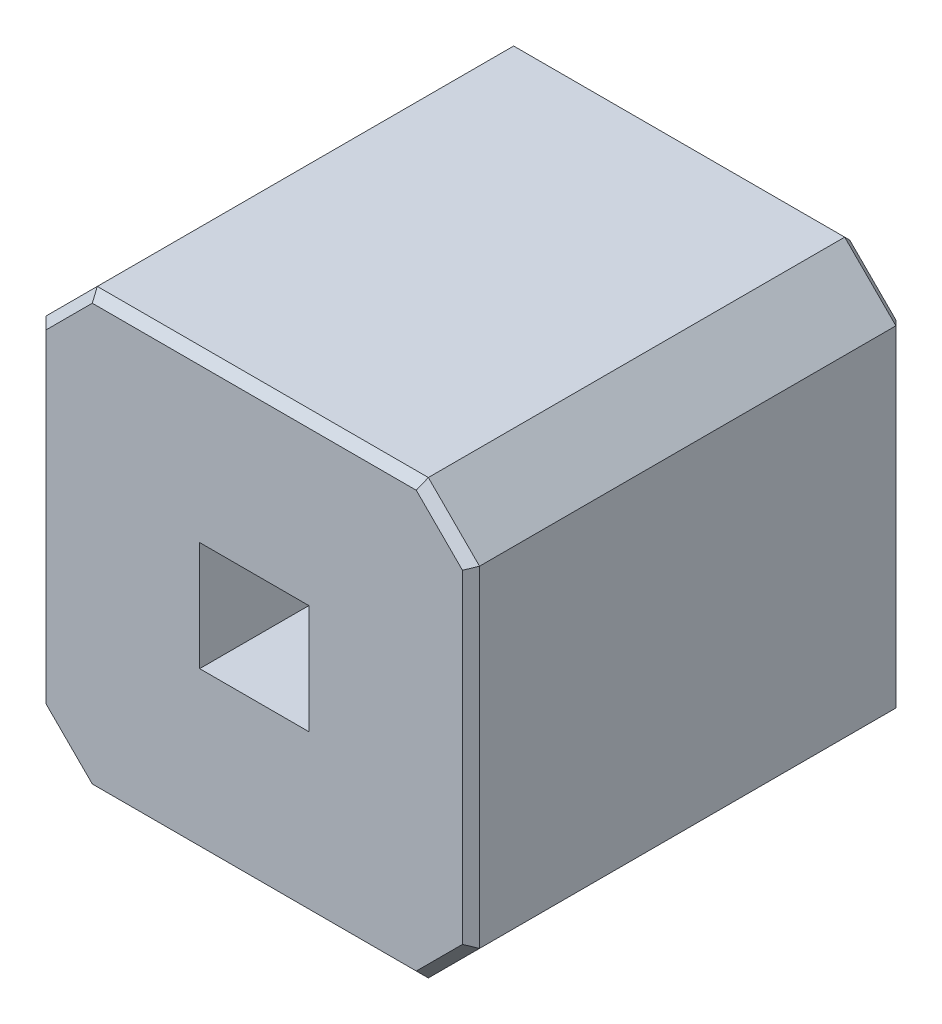
ISO-10303-21;
HEADER;
FILE_DESCRIPTION(('STEP AP214'),'2;1');
FILE_NAME('part.step','',(''),(''),'','','');
FILE_SCHEMA(('AUTOMOTIVE_DESIGN { 1 0 10303 214 1 1 1 1 }'));
ENDSEC;
DATA;
#1=APPLICATION_CONTEXT('core data for automotive mechanical design processes');
#2=APPLICATION_PROTOCOL_DEFINITION('international standard','automotive_design',2000,#1);
#3=PRODUCT_CONTEXT('',#1,'mechanical');
#4=PRODUCT('Part','Part','',(#3));
#5=PRODUCT_RELATED_PRODUCT_CATEGORY('part','',(#4));
#6=PRODUCT_DEFINITION_FORMATION('','',#4);
#7=PRODUCT_DEFINITION_CONTEXT('part definition',#1,'design');
#8=PRODUCT_DEFINITION('design','',#6,#7);
#9=PRODUCT_DEFINITION_SHAPE('','',#8);
#10=(LENGTH_UNIT() NAMED_UNIT(*) SI_UNIT(.MILLI.,.METRE.));
#11=(NAMED_UNIT(*) PLANE_ANGLE_UNIT() SI_UNIT($,.RADIAN.));
#12=(NAMED_UNIT(*) SI_UNIT($,.STERADIAN.) SOLID_ANGLE_UNIT());
#13=UNCERTAINTY_MEASURE_WITH_UNIT(LENGTH_MEASURE(1.E-05),#10,'distance_accuracy_value','');
#14=(GEOMETRIC_REPRESENTATION_CONTEXT(3) GLOBAL_UNCERTAINTY_ASSIGNED_CONTEXT((#13)) GLOBAL_UNIT_ASSIGNED_CONTEXT((#10,
#11,#12)) REPRESENTATION_CONTEXT('',''));
#15=CARTESIAN_POINT('',(0.,0.,0.));
#16=DIRECTION('',(0.,0.,1.));
#17=DIRECTION('',(1.,0.,0.));
#18=AXIS2_PLACEMENT_3D('',#15,#16,#17);
#19=CARTESIAN_POINT('',(1.084644660941,-1.084644660941,0.));
#20=DIRECTION('',(-0.49999999999984,0.49999999999984,0.707106781186774));
#21=DIRECTION('',(0.707106781186548,0.707106781186548,0.));
#22=AXIS2_PLACEMENT_3D('',#19,#20,#21);
#23=PLANE('',#22);
#24=DIRECTION('',(-0.678598344545825,0.281084637714928,-0.678598344545825));
#25=VECTOR('',#24,1.);
#26=CARTESIAN_POINT('',(1.327223070949,-0.993702572068,0.107223070949));
#27=LINE('',#26,#25);
#28=CARTESIAN_POINT('',(1.27,-0.97,0.05));
#29=VERTEX_POINT('',#28);
#30=CARTESIAN_POINT('',(1.22,-0.949289321881,0.));
#31=VERTEX_POINT('',#30);
#32=EDGE_CURVE('E258',#29,#31,#27,.T.);
#33=ORIENTED_EDGE('',*,*,#32,.F.);
#34=DIRECTION('',(0.707106781186548,0.707106781186548,0.));
#35=VECTOR('',#34,1.);
#36=CARTESIAN_POINT('',(1.22,-1.02,0.05));
#37=LINE('',#36,#35);
#38=CARTESIAN_POINT('',(0.97,-1.27,0.05));
#39=VERTEX_POINT('',#38);
#40=EDGE_CURVE('E239',#39,#29,#37,.T.);
#41=ORIENTED_EDGE('',*,*,#40,.F.);
#42=DIRECTION('',(-0.281084637714928,0.678598344545825,-0.678598344545825));
#43=VECTOR('',#42,1.);
#44=CARTESIAN_POINT('',(0.993702572068,-1.327223070949,0.107223070949));
#45=LINE('',#44,#43);
#46=CARTESIAN_POINT('',(0.949289321881,-1.22,0.));
#47=VERTEX_POINT('',#46);
#48=EDGE_CURVE('E11',#39,#47,#45,.T.);
#49=ORIENTED_EDGE('',*,*,#48,.T.);
#50=DIRECTION('',(-0.707106781186548,-0.707106781186548,0.));
#51=VECTOR('',#50,1.);
#52=CARTESIAN_POINT('',(0.934644660941,-1.234644660941,0.));
#53=LINE('',#52,#51);
#54=EDGE_CURVE('E317',#31,#47,#53,.T.);
#55=ORIENTED_EDGE('',*,*,#54,.F.);
#56=EDGE_LOOP('',(#33,#41,#49,#55));
#57=FACE_BOUND('',#56,.T.);
#58=ADVANCED_FACE('F17',(#57),#23,.F.);
#59=CARTESIAN_POINT('',(1.27,-1.27,0.05));
#60=DIRECTION('',(0.,0.707106781186548,0.707106781186548));
#61=DIRECTION('',(1.,0.,0.));
#62=AXIS2_PLACEMENT_3D('',#59,#60,#61);
#63=PLANE('',#62);
#64=DIRECTION('',(0.281084637714928,0.678598344545825,-0.678598344545825));
#65=VECTOR('',#64,1.);
#66=CARTESIAN_POINT('',(-0.792261948312,-0.840902385064,-0.379097614936));
#67=LINE('',#66,#65);
#68=CARTESIAN_POINT('',(-0.97,-1.27,0.05));
#69=VERTEX_POINT('',#68);
#70=CARTESIAN_POINT('',(-0.949289321881,-1.22,0.));
#71=VERTEX_POINT('',#70);
#72=EDGE_CURVE('E27',#69,#71,#67,.T.);
#73=ORIENTED_EDGE('',*,*,#72,.T.);
#74=DIRECTION('',(-1.,0.,0.));
#75=VECTOR('',#74,1.);
#76=CARTESIAN_POINT('',(-1.27,-1.22,0.));
#77=LINE('',#76,#75);
#78=EDGE_CURVE('E311',#47,#71,#77,.T.);
#79=ORIENTED_EDGE('',*,*,#78,.F.);
#80=ORIENTED_EDGE('',*,*,#48,.F.);
#81=DIRECTION('',(1.,0.,0.));
#82=VECTOR('',#81,1.);
#83=CARTESIAN_POINT('',(1.27,-1.27,0.05));
#84=LINE('',#83,#82);
#85=EDGE_CURVE('E364',#69,#39,#84,.T.);
#86=ORIENTED_EDGE('',*,*,#85,.F.);
#87=EDGE_LOOP('',(#73,#79,#80,#86));
#88=FACE_BOUND('',#87,.T.);
#89=ADVANCED_FACE('F713',(#88),#63,.F.);
#90=CARTESIAN_POINT('',(-2.354644660941,0.185355339059,0.));
#91=DIRECTION('',(0.49999999999984,0.49999999999984,0.707106781186774));
#92=DIRECTION('',(0.707106781186548,-0.707106781186548,0.));
#93=AXIS2_PLACEMENT_3D('',#90,#91,#92);
#94=PLANE('',#93);
#95=DIRECTION('',(0.678598344545825,0.281084637714928,-0.678598344545825));
#96=VECTOR('',#95,1.);
#97=CARTESIAN_POINT('',(-1.327223070949,-0.993702572068,0.107223070949));
#98=LINE('',#97,#96);
#99=CARTESIAN_POINT('',(-1.27,-0.97,0.05));
#100=VERTEX_POINT('',#99);
#101=CARTESIAN_POINT('',(-1.22,-0.949289321881,0.));
#102=VERTEX_POINT('',#101);
#103=EDGE_CURVE('E20',#100,#102,#98,.T.);
#104=ORIENTED_EDGE('',*,*,#103,.T.);
#105=DIRECTION('',(-0.707106781186548,0.707106781186548,0.));
#106=VECTOR('',#105,1.);
#107=CARTESIAN_POINT('',(-1.234644660941,-0.934644660941,0.));
#108=LINE('',#107,#106);
#109=EDGE_CURVE('E296',#71,#102,#108,.T.);
#110=ORIENTED_EDGE('',*,*,#109,.F.);
#111=ORIENTED_EDGE('',*,*,#72,.F.);
#112=DIRECTION('',(0.707106781186548,-0.707106781186548,0.));
#113=VECTOR('',#112,1.);
#114=CARTESIAN_POINT('',(-0.97,-1.27,0.05));
#115=LINE('',#114,#113);
#116=EDGE_CURVE('E240',#100,#69,#115,.T.);
#117=ORIENTED_EDGE('',*,*,#116,.F.);
#118=EDGE_LOOP('',(#104,#110,#111,#117));
#119=FACE_BOUND('',#118,.T.);
#120=ADVANCED_FACE('F294',(#119),#94,.F.);
#121=CARTESIAN_POINT('',(-1.27,-1.27,0.05));
#122=DIRECTION('',(0.707106781186548,0.,0.707106781186548));
#123=DIRECTION('',(0.,-1.,0.));
#124=AXIS2_PLACEMENT_3D('',#121,#122,#123);
#125=PLANE('',#124);
#126=DIRECTION('',(0.678598344545825,-0.281084637714928,-0.678598344545825));
#127=VECTOR('',#126,1.);
#128=CARTESIAN_POINT('',(-1.183487607169,0.934165393576,-0.03651239283051));
#129=LINE('',#128,#127);
#130=CARTESIAN_POINT('',(-1.27,0.97,0.05));
#131=VERTEX_POINT('',#130);
#132=CARTESIAN_POINT('',(-1.22,0.949289321881,0.));
#133=VERTEX_POINT('',#132);
#134=EDGE_CURVE('E280',#131,#133,#129,.T.);
#135=ORIENTED_EDGE('',*,*,#134,.T.);
#136=DIRECTION('',(0.,1.,0.));
#137=VECTOR('',#136,1.);
#138=CARTESIAN_POINT('',(-1.22,1.27,0.));
#139=LINE('',#138,#137);
#140=EDGE_CURVE('E300',#102,#133,#139,.T.);
#141=ORIENTED_EDGE('',*,*,#140,.F.);
#142=ORIENTED_EDGE('',*,*,#103,.F.);
#143=DIRECTION('',(0.,-1.,0.));
#144=VECTOR('',#143,1.);
#145=CARTESIAN_POINT('',(-1.27,-1.27,0.05));
#146=LINE('',#145,#144);
#147=EDGE_CURVE('E348',#131,#100,#146,.T.);
#148=ORIENTED_EDGE('',*,*,#147,.F.);
#149=EDGE_LOOP('',(#135,#141,#142,#148));
#150=FACE_BOUND('',#149,.T.);
#151=ADVANCED_FACE('F301',(#150),#125,.F.);
#152=CARTESIAN_POINT('',(-1.084644660941,1.084644660941,0.));
#153=DIRECTION('',(0.49999999999984,-0.49999999999984,0.707106781186774));
#154=DIRECTION('',(-0.707106781186548,-0.707106781186548,0.));
#155=AXIS2_PLACEMENT_3D('',#152,#153,#154);
#156=PLANE('',#155);
#157=DIRECTION('',(-0.281084637714928,0.678598344545825,0.678598344545825));
#158=VECTOR('',#157,1.);
#159=CARTESIAN_POINT('',(-0.793020795227,0.84273440358,-0.37726559642));
#160=LINE('',#159,#158);
#161=CARTESIAN_POINT('',(-0.949289321881,1.22,0.));
#162=VERTEX_POINT('',#161);
#163=CARTESIAN_POINT('',(-0.97,1.27,0.05));
#164=VERTEX_POINT('',#163);
#165=EDGE_CURVE('E190',#162,#164,#160,.T.);
#166=ORIENTED_EDGE('',*,*,#165,.F.);
#167=DIRECTION('',(0.707106781186548,0.707106781186548,0.));
#168=VECTOR('',#167,1.);
#169=CARTESIAN_POINT('',(-0.984644660941,1.184644660941,0.));
#170=LINE('',#169,#168);
#171=EDGE_CURVE('E305',#133,#162,#170,.T.);
#172=ORIENTED_EDGE('',*,*,#171,.F.);
#173=ORIENTED_EDGE('',*,*,#134,.F.);
#174=DIRECTION('',(-0.707106781186548,-0.707106781186548,0.));
#175=VECTOR('',#174,1.);
#176=CARTESIAN_POINT('',(-1.27,0.97,0.05));
#177=LINE('',#176,#175);
#178=EDGE_CURVE('E256',#164,#131,#177,.T.);
#179=ORIENTED_EDGE('',*,*,#178,.F.);
#180=EDGE_LOOP('',(#166,#172,#173,#179));
#181=FACE_BOUND('',#180,.T.);
#182=ADVANCED_FACE('F711',(#181),#156,.F.);
#183=CARTESIAN_POINT('',(-1.084644660941,1.084644660941,2.54));
#184=DIRECTION('',(-0.49999999999984,0.49999999999984,0.707106781186774));
#185=DIRECTION('',(0.707106781186548,0.707106781186548,0.));
#186=AXIS2_PLACEMENT_3D('',#183,#184,#185);
#187=PLANE('',#186);
#188=DIRECTION('',(-0.281084637714928,0.678598344545825,-0.678598344545825));
#189=VECTOR('',#188,1.);
#190=CARTESIAN_POINT('',(-0.974628215085,1.281173499627,2.478826500373));
#191=LINE('',#190,#189);
#192=CARTESIAN_POINT('',(-0.949289321881,1.22,2.54));
#193=VERTEX_POINT('',#192);
#194=CARTESIAN_POINT('',(-0.97,1.27,2.49));
#195=VERTEX_POINT('',#194);
#196=EDGE_CURVE('E40',#193,#195,#191,.T.);
#197=ORIENTED_EDGE('',*,*,#196,.T.);
#198=DIRECTION('',(0.707106781186548,0.707106781186548,0.));
#199=VECTOR('',#198,1.);
#200=CARTESIAN_POINT('',(-1.27,0.97,2.49));
#201=LINE('',#200,#199);
#202=CARTESIAN_POINT('',(-1.27,0.97,2.49));
#203=VERTEX_POINT('',#202);
#204=EDGE_CURVE('E203',#203,#195,#201,.T.);
#205=ORIENTED_EDGE('',*,*,#204,.F.);
#206=DIRECTION('',(0.678598344545825,-0.281084637714928,0.678598344545825));
#207=VECTOR('',#206,1.);
#208=CARTESIAN_POINT('',(-1.281173499627,0.974628215085,2.478826500373));
#209=LINE('',#208,#207);
#210=CARTESIAN_POINT('',(-1.22,0.949289321881,2.54));
#211=VERTEX_POINT('',#210);
#212=EDGE_CURVE('E277',#203,#211,#209,.T.);
#213=ORIENTED_EDGE('',*,*,#212,.T.);
#214=DIRECTION('',(-0.707106781186548,-0.707106781186548,0.));
#215=VECTOR('',#214,1.);
#216=CARTESIAN_POINT('',(-1.084644660941,1.084644660941,2.54));
#217=LINE('',#216,#215);
#218=EDGE_CURVE('E436',#193,#211,#217,.T.);
#219=ORIENTED_EDGE('',*,*,#218,.F.);
#220=EDGE_LOOP('',(#197,#205,#213,#219));
#221=FACE_BOUND('',#220,.T.);
#222=ADVANCED_FACE('F434',(#221),#187,.T.);
#223=CARTESIAN_POINT('',(-1.22,1.27,2.54));
#224=DIRECTION('',(-0.707106781186548,0.,0.707106781186548));
#225=DIRECTION('',(0.,1.,0.));
#226=AXIS2_PLACEMENT_3D('',#223,#224,#225);
#227=PLANE('',#226);
#228=DIRECTION('',(0.678598344545825,0.281084637714928,0.678598344545825));
#229=VECTOR('',#228,1.);
#230=CARTESIAN_POINT('',(-1.526072829275,-1.076068838841,2.233927170725));
#231=LINE('',#230,#229);
#232=CARTESIAN_POINT('',(-1.27,-0.97,2.49));
#233=VERTEX_POINT('',#232);
#234=CARTESIAN_POINT('',(-1.22,-0.949289321881,2.54));
#235=VERTEX_POINT('',#234);
#236=EDGE_CURVE('E271',#233,#235,#231,.T.);
#237=ORIENTED_EDGE('',*,*,#236,.T.);
#238=DIRECTION('',(0.,-1.,0.));
#239=VECTOR('',#238,1.);
#240=CARTESIAN_POINT('',(-1.22,-0.97,2.54));
#241=LINE('',#240,#239);
#242=EDGE_CURVE('E441',#211,#235,#241,.T.);
#243=ORIENTED_EDGE('',*,*,#242,.F.);
#244=ORIENTED_EDGE('',*,*,#212,.F.);
#245=DIRECTION('',(0.,1.,0.));
#246=VECTOR('',#245,1.);
#247=CARTESIAN_POINT('',(-1.27,0.97,2.49));
#248=LINE('',#247,#246);
#249=EDGE_CURVE('E356',#233,#203,#248,.T.);
#250=ORIENTED_EDGE('',*,*,#249,.F.);
#251=EDGE_LOOP('',(#237,#243,#244,#250));
#252=FACE_BOUND('',#251,.T.);
#253=ADVANCED_FACE('F442',(#252),#227,.T.);
#254=CARTESIAN_POINT('',(-1.27,1.22,2.54));
#255=DIRECTION('',(0.,0.707106781186548,0.707106781186548));
#256=DIRECTION('',(1.,0.,0.));
#257=AXIS2_PLACEMENT_3D('',#254,#255,#256);
#258=PLANE('',#257);
#259=DIRECTION('',(0.281084637714928,0.678598344545825,-0.678598344545825));
#260=VECTOR('',#259,1.);
#261=CARTESIAN_POINT('',(0.773946438244,0.796684832258,2.963315167742));
#262=LINE('',#261,#260);
#263=CARTESIAN_POINT('',(0.949289321881,1.22,2.54));
#264=VERTEX_POINT('',#263);
#265=CARTESIAN_POINT('',(0.97,1.27,2.49));
#266=VERTEX_POINT('',#265);
#267=EDGE_CURVE('E268',#264,#266,#262,.T.);
#268=ORIENTED_EDGE('',*,*,#267,.T.);
#269=DIRECTION('',(1.,0.,0.));
#270=VECTOR('',#269,1.);
#271=CARTESIAN_POINT('',(0.97,1.27,2.49));
#272=LINE('',#271,#270);
#273=EDGE_CURVE('E217',#195,#266,#272,.T.);
#274=ORIENTED_EDGE('',*,*,#273,.F.);
#275=ORIENTED_EDGE('',*,*,#196,.F.);
#276=DIRECTION('',(-1.,0.,0.));
#277=VECTOR('',#276,1.);
#278=CARTESIAN_POINT('',(-0.97,1.22,2.54));
#279=LINE('',#278,#277);
#280=EDGE_CURVE('E449',#264,#193,#279,.T.);
#281=ORIENTED_EDGE('',*,*,#280,.F.);
#282=EDGE_LOOP('',(#268,#274,#275,#281));
#283=FACE_BOUND('',#282,.T.);
#284=ADVANCED_FACE('F706',(#283),#258,.T.);
#285=CARTESIAN_POINT('',(-2.354644660941,0.185355339059,2.54));
#286=DIRECTION('',(-0.49999999999984,-0.49999999999984,0.707106781186774));
#287=DIRECTION('',(-0.707106781186548,0.707106781186548,0.));
#288=AXIS2_PLACEMENT_3D('',#285,#286,#287);
#289=PLANE('',#288);
#290=DIRECTION('',(0.281084637714928,0.678598344545825,0.678598344545825));
#291=VECTOR('',#290,1.);
#292=CARTESIAN_POINT('',(-0.974628215085,-1.281173499627,2.478826500373));
#293=LINE('',#292,#291);
#294=CARTESIAN_POINT('',(-0.97,-1.27,2.49));
#295=VERTEX_POINT('',#294);
#296=CARTESIAN_POINT('',(-0.949289321881,-1.22,2.54));
#297=VERTEX_POINT('',#296);
#298=EDGE_CURVE('E272',#295,#297,#293,.T.);
#299=ORIENTED_EDGE('',*,*,#298,.T.);
#300=DIRECTION('',(0.707106781186548,-0.707106781186548,0.));
#301=VECTOR('',#300,1.);
#302=CARTESIAN_POINT('',(-2.354644660941,0.185355339059,2.54));
#303=LINE('',#302,#301);
#304=EDGE_CURVE('E446',#235,#297,#303,.T.);
#305=ORIENTED_EDGE('',*,*,#304,.F.);
#306=ORIENTED_EDGE('',*,*,#236,.F.);
#307=DIRECTION('',(-0.707106781186548,0.707106781186548,0.));
#308=VECTOR('',#307,1.);
#309=CARTESIAN_POINT('',(-0.97,-1.27,2.49));
#310=LINE('',#309,#308);
#311=EDGE_CURVE('E235',#295,#233,#310,.T.);
#312=ORIENTED_EDGE('',*,*,#311,.F.);
#313=EDGE_LOOP('',(#299,#305,#306,#312));
#314=FACE_BOUND('',#313,.T.);
#315=ADVANCED_FACE('F694',(#314),#289,.T.);
#316=CARTESIAN_POINT('',(-0.185355339059,2.354644660941,2.54));
#317=DIRECTION('',(0.49999999999984,0.49999999999984,0.707106781186774));
#318=DIRECTION('',(0.707106781186548,-0.707106781186548,0.));
#319=AXIS2_PLACEMENT_3D('',#316,#317,#318);
#320=PLANE('',#319);
#321=DIRECTION('',(0.678598344545825,0.281084637714928,-0.678598344545825));
#322=VECTOR('',#321,1.);
#323=CARTESIAN_POINT('',(0.840902385064,0.792261948312,2.919097614936));
#324=LINE('',#323,#322);
#325=CARTESIAN_POINT('',(1.22,0.949289321881,2.54));
#326=VERTEX_POINT('',#325);
#327=CARTESIAN_POINT('',(1.27,0.97,2.49));
#328=VERTEX_POINT('',#327);
#329=EDGE_CURVE('E267',#326,#328,#324,.T.);
#330=ORIENTED_EDGE('',*,*,#329,.T.);
#331=DIRECTION('',(0.707106781186548,-0.707106781186548,0.));
#332=VECTOR('',#331,1.);
#333=CARTESIAN_POINT('',(0.97,1.27,2.49));
#334=LINE('',#333,#332);
#335=EDGE_CURVE('E202',#266,#328,#334,.T.);
#336=ORIENTED_EDGE('',*,*,#335,.F.);
#337=ORIENTED_EDGE('',*,*,#267,.F.);
#338=DIRECTION('',(-0.707106781186548,0.707106781186548,0.));
#339=VECTOR('',#338,1.);
#340=CARTESIAN_POINT('',(-0.185355339059,2.354644660941,2.54));
#341=LINE('',#340,#339);
#342=EDGE_CURVE('E490',#326,#264,#341,.T.);
#343=ORIENTED_EDGE('',*,*,#342,.F.);
#344=EDGE_LOOP('',(#330,#336,#337,#343));
#345=FACE_BOUND('',#344,.T.);
#346=ADVANCED_FACE('F705',(#345),#320,.T.);
#347=CARTESIAN_POINT('',(-1.27,-1.22,2.54));
#348=DIRECTION('',(0.,-0.707106781186548,0.707106781186548));
#349=DIRECTION('',(-1.,0.,0.));
#350=AXIS2_PLACEMENT_3D('',#347,#348,#349);
#351=PLANE('',#350);
#352=DIRECTION('',(-0.281084637714928,0.678598344545825,0.678598344545825));
#353=VECTOR('',#352,1.);
#354=CARTESIAN_POINT('',(0.934165393576,-1.183487607169,2.576512392831));
#355=LINE('',#354,#353);
#356=CARTESIAN_POINT('',(0.97,-1.27,2.49));
#357=VERTEX_POINT('',#356);
#358=CARTESIAN_POINT('',(0.949289321881,-1.22,2.54));
#359=VERTEX_POINT('',#358);
#360=EDGE_CURVE('E261',#357,#359,#355,.T.);
#361=ORIENTED_EDGE('',*,*,#360,.T.);
#362=DIRECTION('',(1.,0.,0.));
#363=VECTOR('',#362,1.);
#364=CARTESIAN_POINT('',(0.97,-1.22,2.54));
#365=LINE('',#364,#363);
#366=EDGE_CURVE('E468',#297,#359,#365,.T.);
#367=ORIENTED_EDGE('',*,*,#366,.F.);
#368=ORIENTED_EDGE('',*,*,#298,.F.);
#369=DIRECTION('',(-1.,0.,0.));
#370=VECTOR('',#369,1.);
#371=CARTESIAN_POINT('',(-0.97,-1.27,2.49));
#372=LINE('',#371,#370);
#373=EDGE_CURVE('E371',#357,#295,#372,.T.);
#374=ORIENTED_EDGE('',*,*,#373,.F.);
#375=EDGE_LOOP('',(#361,#367,#368,#374));
#376=FACE_BOUND('',#375,.T.);
#377=ADVANCED_FACE('F698',(#376),#351,.T.);
#378=CARTESIAN_POINT('',(1.22,1.27,2.54));
#379=DIRECTION('',(0.707106781186548,0.,0.707106781186548));
#380=DIRECTION('',(0.,-1.,0.));
#381=AXIS2_PLACEMENT_3D('',#378,#379,#380);
#382=PLANE('',#381);
#383=DIRECTION('',(0.678598344545825,-0.281084637714928,-0.678598344545825));
#384=VECTOR('',#383,1.);
#385=CARTESIAN_POINT('',(0.796684832258,-0.773946438244,2.963315167742));
#386=LINE('',#385,#384);
#387=CARTESIAN_POINT('',(1.22,-0.949289321881,2.54));
#388=VERTEX_POINT('',#387);
#389=CARTESIAN_POINT('',(1.27,-0.97,2.49));
#390=VERTEX_POINT('',#389);
#391=EDGE_CURVE('E264',#388,#390,#386,.T.);
#392=ORIENTED_EDGE('',*,*,#391,.T.);
#393=DIRECTION('',(0.,-1.,0.));
#394=VECTOR('',#393,1.);
#395=CARTESIAN_POINT('',(1.27,-0.97,2.49));
#396=LINE('',#395,#394);
#397=EDGE_CURVE('E219',#328,#390,#396,.T.);
#398=ORIENTED_EDGE('',*,*,#397,.F.);
#399=ORIENTED_EDGE('',*,*,#329,.F.);
#400=DIRECTION('',(0.,1.,0.));
#401=VECTOR('',#400,1.);
#402=CARTESIAN_POINT('',(1.22,0.97,2.54));
#403=LINE('',#402,#401);
#404=EDGE_CURVE('E483',#388,#326,#403,.T.);
#405=ORIENTED_EDGE('',*,*,#404,.F.);
#406=EDGE_LOOP('',(#392,#398,#399,#405));
#407=FACE_BOUND('',#406,.T.);
#408=ADVANCED_FACE('F704',(#407),#382,.T.);
#409=CARTESIAN_POINT('',(1.084644660941,-1.084644660941,2.54));
#410=DIRECTION('',(0.49999999999984,-0.49999999999984,0.707106781186774));
#411=DIRECTION('',(-0.707106781186548,-0.707106781186548,0.));
#412=AXIS2_PLACEMENT_3D('',#409,#410,#411);
#413=PLANE('',#412);
#414=ORIENTED_EDGE('',*,*,#360,.F.);
#415=DIRECTION('',(-0.707106781186548,-0.707106781186548,0.));
#416=VECTOR('',#415,1.);
#417=CARTESIAN_POINT('',(1.27,-0.97,2.49));
#418=LINE('',#417,#416);
#419=EDGE_CURVE('E253',#390,#357,#418,.T.);
#420=ORIENTED_EDGE('',*,*,#419,.F.);
#421=ORIENTED_EDGE('',*,*,#391,.F.);
#422=DIRECTION('',(0.707106781186548,0.707106781186548,0.));
#423=VECTOR('',#422,1.);
#424=CARTESIAN_POINT('',(1.084644660941,-1.084644660941,2.54));
#425=LINE('',#424,#423);
#426=EDGE_CURVE('E479',#359,#388,#425,.T.);
#427=ORIENTED_EDGE('',*,*,#426,.F.);
#428=EDGE_LOOP('',(#414,#420,#421,#427));
#429=FACE_BOUND('',#428,.T.);
#430=ADVANCED_FACE('F701',(#429),#413,.T.);
#431=CARTESIAN_POINT('',(1.27,-1.27,0.05));
#432=DIRECTION('',(-0.707106781186548,0.,0.707106781186548));
#433=DIRECTION('',(0.,1.,0.));
#434=AXIS2_PLACEMENT_3D('',#431,#432,#433);
#435=PLANE('',#434);
#436=DIRECTION('',(0.,1.,0.));
#437=VECTOR('',#436,1.);
#438=CARTESIAN_POINT('',(1.27,-1.27,0.05));
#439=LINE('',#438,#437);
#440=CARTESIAN_POINT('',(1.27,0.97,0.05));
#441=VERTEX_POINT('',#440);
#442=EDGE_CURVE('E379',#29,#441,#439,.T.);
#443=ORIENTED_EDGE('',*,*,#442,.F.);
#444=ORIENTED_EDGE('',*,*,#32,.T.);
#445=DIRECTION('',(0.,-1.,0.));
#446=VECTOR('',#445,1.);
#447=CARTESIAN_POINT('',(1.22,1.27,0.));
#448=LINE('',#447,#446);
#449=CARTESIAN_POINT('',(1.22,0.949289321881,0.));
#450=VERTEX_POINT('',#449);
#451=EDGE_CURVE('E460',#450,#31,#448,.T.);
#452=ORIENTED_EDGE('',*,*,#451,.F.);
#453=DIRECTION('',(0.678598344545825,0.281084637714928,0.678598344545825));
#454=VECTOR('',#453,1.);
#455=CARTESIAN_POINT('',(0.840902385064,0.792261948312,-0.379097614936));
#456=LINE('',#455,#454);
#457=EDGE_CURVE('E189',#450,#441,#456,.T.);
#458=ORIENTED_EDGE('',*,*,#457,.T.);
#459=EDGE_LOOP('',(#443,#444,#452,#458));
#460=FACE_BOUND('',#459,.T.);
#461=ADVANCED_FACE('F392',(#460),#435,.F.);
#462=CARTESIAN_POINT('',(-0.185355339059,2.354644660941,0.));
#463=DIRECTION('',(-0.49999999999984,-0.49999999999984,0.707106781186774));
#464=DIRECTION('',(-0.707106781186548,0.707106781186548,0.));
#465=AXIS2_PLACEMENT_3D('',#462,#463,#464);
#466=PLANE('',#465);
#467=DIRECTION('',(0.281084637714928,0.678598344545825,0.678598344545825));
#468=VECTOR('',#467,1.);
#469=CARTESIAN_POINT('',(0.993702572068,1.327223070949,0.107223070949));
#470=LINE('',#469,#468);
#471=CARTESIAN_POINT('',(0.949289321881,1.22,0.));
#472=VERTEX_POINT('',#471);
#473=CARTESIAN_POINT('',(0.97,1.27,0.05));
#474=VERTEX_POINT('',#473);
#475=EDGE_CURVE('E177',#472,#474,#470,.T.);
#476=ORIENTED_EDGE('',*,*,#475,.T.);
#477=DIRECTION('',(-0.707106781186548,0.707106781186548,0.));
#478=VECTOR('',#477,1.);
#479=CARTESIAN_POINT('',(0.97,1.27,0.05));
#480=LINE('',#479,#478);
#481=EDGE_CURVE('E180',#441,#474,#480,.T.);
#482=ORIENTED_EDGE('',*,*,#481,.F.);
#483=ORIENTED_EDGE('',*,*,#457,.F.);
#484=DIRECTION('',(0.707106781186548,-0.707106781186548,0.));
#485=VECTOR('',#484,1.);
#486=CARTESIAN_POINT('',(1.234644660941,0.934644660941,0.));
#487=LINE('',#486,#485);
#488=EDGE_CURVE('E183',#472,#450,#487,.T.);
#489=ORIENTED_EDGE('',*,*,#488,.F.);
#490=EDGE_LOOP('',(#476,#482,#483,#489));
#491=FACE_BOUND('',#490,.T.);
#492=ADVANCED_FACE('F179',(#491),#466,.F.);
#493=CARTESIAN_POINT('',(1.27,1.27,0.05));
#494=DIRECTION('',(0.,-0.707106781186548,0.707106781186548));
#495=DIRECTION('',(-1.,0.,0.));
#496=AXIS2_PLACEMENT_3D('',#493,#494,#495);
#497=PLANE('',#496);
#498=DIRECTION('',(1.,0.,0.));
#499=VECTOR('',#498,1.);
#500=CARTESIAN_POINT('',(-1.27,1.22,0.));
#501=LINE('',#500,#499);
#502=EDGE_CURVE('E327',#162,#472,#501,.T.);
#503=ORIENTED_EDGE('',*,*,#502,.F.);
#504=ORIENTED_EDGE('',*,*,#165,.T.);
#505=DIRECTION('',(-1.,0.,0.));
#506=VECTOR('',#505,1.);
#507=CARTESIAN_POINT('',(1.27,1.27,0.05));
#508=LINE('',#507,#506);
#509=EDGE_CURVE('E206',#474,#164,#508,.T.);
#510=ORIENTED_EDGE('',*,*,#509,.F.);
#511=ORIENTED_EDGE('',*,*,#475,.F.);
#512=EDGE_LOOP('',(#503,#504,#510,#511));
#513=FACE_BOUND('',#512,.T.);
#514=ADVANCED_FACE('F207',(#513),#497,.F.);
#515=CARTESIAN_POINT('',(0.97,1.27,2.54));
#516=DIRECTION('',(-0.707106781186548,-0.707106781186548,0.));
#517=DIRECTION('',(-0.707106781186548,0.707106781186548,0.));
#518=AXIS2_PLACEMENT_3D('',#515,#516,#517);
#519=PLANE('',#518);
#520=DIRECTION('',(0.,0.,1.));
#521=VECTOR('',#520,1.);
#522=CARTESIAN_POINT('',(1.27,0.97,2.54));
#523=LINE('',#522,#521);
#524=EDGE_CURVE('E199',#441,#328,#523,.T.);
#525=ORIENTED_EDGE('',*,*,#524,.F.);
#526=ORIENTED_EDGE('',*,*,#481,.T.);
#527=DIRECTION('',(0.,0.,-1.));
#528=VECTOR('',#527,1.);
#529=CARTESIAN_POINT('',(0.97,1.27,2.54));
#530=LINE('',#529,#528);
#531=EDGE_CURVE('E197',#266,#474,#530,.T.);
#532=ORIENTED_EDGE('',*,*,#531,.F.);
#533=ORIENTED_EDGE('',*,*,#335,.T.);
#534=EDGE_LOOP('',(#525,#526,#532,#533));
#535=FACE_BOUND('',#534,.T.);
#536=ADVANCED_FACE('F194',(#535),#519,.F.);
#537=CARTESIAN_POINT('',(-1.27,0.97,2.54));
#538=DIRECTION('',(0.707106781186548,-0.707106781186548,0.));
#539=DIRECTION('',(0.,0.,-1.));
#540=AXIS2_PLACEMENT_3D('',#537,#538,#539);
#541=PLANE('',#540);
#542=DIRECTION('',(0.,0.,1.));
#543=VECTOR('',#542,1.);
#544=CARTESIAN_POINT('',(-0.97,1.27,2.54));
#545=LINE('',#544,#543);
#546=EDGE_CURVE('E212',#164,#195,#545,.T.);
#547=ORIENTED_EDGE('',*,*,#546,.F.);
#548=ORIENTED_EDGE('',*,*,#178,.T.);
#549=DIRECTION('',(0.,0.,-1.));
#550=VECTOR('',#549,1.);
#551=CARTESIAN_POINT('',(-1.27,0.97,2.54));
#552=LINE('',#551,#550);
#553=EDGE_CURVE('E344',#203,#131,#552,.T.);
#554=ORIENTED_EDGE('',*,*,#553,.F.);
#555=ORIENTED_EDGE('',*,*,#204,.T.);
#556=EDGE_LOOP('',(#547,#548,#554,#555));
#557=FACE_BOUND('',#556,.T.);
#558=ADVANCED_FACE('F709',(#557),#541,.F.);
#559=CARTESIAN_POINT('',(1.27,-0.97,2.54));
#560=DIRECTION('',(-0.707106781186548,0.707106781186548,0.));
#561=DIRECTION('',(0.,0.,1.));
#562=AXIS2_PLACEMENT_3D('',#559,#560,#561);
#563=PLANE('',#562);
#564=DIRECTION('',(0.,0.,1.));
#565=VECTOR('',#564,1.);
#566=CARTESIAN_POINT('',(0.97,-1.27,2.54));
#567=LINE('',#566,#565);
#568=EDGE_CURVE('E370',#39,#357,#567,.T.);
#569=ORIENTED_EDGE('',*,*,#568,.F.);
#570=ORIENTED_EDGE('',*,*,#40,.T.);
#571=DIRECTION('',(0.,0.,-1.));
#572=VECTOR('',#571,1.);
#573=CARTESIAN_POINT('',(1.27,-0.97,2.54));
#574=LINE('',#573,#572);
#575=EDGE_CURVE('E375',#390,#29,#574,.T.);
#576=ORIENTED_EDGE('',*,*,#575,.F.);
#577=ORIENTED_EDGE('',*,*,#419,.T.);
#578=EDGE_LOOP('',(#569,#570,#576,#577));
#579=FACE_BOUND('',#578,.T.);
#580=ADVANCED_FACE('F744',(#579),#563,.F.);
#581=CARTESIAN_POINT('',(-0.97,-1.27,2.54));
#582=DIRECTION('',(0.707106781186548,0.707106781186548,0.));
#583=DIRECTION('',(0.,0.,-1.));
#584=AXIS2_PLACEMENT_3D('',#581,#582,#583);
#585=PLANE('',#584);
#586=DIRECTION('',(0.,0.,1.));
#587=VECTOR('',#586,1.);
#588=CARTESIAN_POINT('',(-1.27,-0.97,2.54));
#589=LINE('',#588,#587);
#590=EDGE_CURVE('E320',#100,#233,#589,.T.);
#591=ORIENTED_EDGE('',*,*,#590,.F.);
#592=ORIENTED_EDGE('',*,*,#116,.T.);
#593=DIRECTION('',(0.,0.,-1.));
#594=VECTOR('',#593,1.);
#595=CARTESIAN_POINT('',(-0.97,-1.27,2.54));
#596=LINE('',#595,#594);
#597=EDGE_CURVE('E360',#295,#69,#596,.T.);
#598=ORIENTED_EDGE('',*,*,#597,.F.);
#599=ORIENTED_EDGE('',*,*,#311,.T.);
#600=EDGE_LOOP('',(#591,#592,#598,#599));
#601=FACE_BOUND('',#600,.T.);
#602=ADVANCED_FACE('F691',(#601),#585,.F.);
#603=CARTESIAN_POINT('',(0.32,0.32,2.54));
#604=DIRECTION('',(0.,-1.,0.));
#605=DIRECTION('',(0.,0.,-1.));
#606=AXIS2_PLACEMENT_3D('',#603,#604,#605);
#607=PLANE('',#606);
#608=DIRECTION('',(-1.,0.,0.));
#609=VECTOR('',#608,1.);
#610=CARTESIAN_POINT('',(0.32,0.32,0.));
#611=LINE('',#610,#609);
#612=CARTESIAN_POINT('',(0.32,0.32,0.));
#613=VERTEX_POINT('',#612);
#614=CARTESIAN_POINT('',(-0.32,0.32,0.));
#615=VERTEX_POINT('',#614);
#616=EDGE_CURVE('E349',#613,#615,#611,.T.);
#617=ORIENTED_EDGE('',*,*,#616,.F.);
#618=DIRECTION('',(0.,0.,-1.));
#619=VECTOR('',#618,1.);
#620=CARTESIAN_POINT('',(0.32,0.32,2.54));
#621=LINE('',#620,#619);
#622=CARTESIAN_POINT('',(0.32,0.32,2.54));
#623=VERTEX_POINT('',#622);
#624=EDGE_CURVE('E244',#623,#613,#621,.T.);
#625=ORIENTED_EDGE('',*,*,#624,.F.);
#626=DIRECTION('',(-1.,0.,0.));
#627=VECTOR('',#626,1.);
#628=CARTESIAN_POINT('',(0.32,0.32,2.54));
#629=LINE('',#628,#627);
#630=CARTESIAN_POINT('',(-0.32,0.32,2.54));
#631=VERTEX_POINT('',#630);
#632=EDGE_CURVE('E475',#623,#631,#629,.T.);
#633=ORIENTED_EDGE('',*,*,#632,.T.);
#634=DIRECTION('',(0.,0.,-1.));
#635=VECTOR('',#634,1.);
#636=CARTESIAN_POINT('',(-0.32,0.32,2.54));
#637=LINE('',#636,#635);
#638=EDGE_CURVE('E231',#631,#615,#637,.T.);
#639=ORIENTED_EDGE('',*,*,#638,.T.);
#640=EDGE_LOOP('',(#617,#625,#633,#639));
#641=FACE_BOUND('',#640,.T.);
#642=ADVANCED_FACE('F761',(#641),#607,.T.);
#643=CARTESIAN_POINT('',(0.32,-0.32,2.54));
#644=DIRECTION('',(-1.,0.,0.));
#645=DIRECTION('',(0.,0.,1.));
#646=AXIS2_PLACEMENT_3D('',#643,#644,#645);
#647=PLANE('',#646);
#648=DIRECTION('',(0.,1.,0.));
#649=VECTOR('',#648,1.);
#650=CARTESIAN_POINT('',(0.32,-0.32,0.));
#651=LINE('',#650,#649);
#652=CARTESIAN_POINT('',(0.32,-0.32,0.));
#653=VERTEX_POINT('',#652);
#654=EDGE_CURVE('E343',#653,#613,#651,.T.);
#655=ORIENTED_EDGE('',*,*,#654,.F.);
#656=DIRECTION('',(0.,0.,-1.));
#657=VECTOR('',#656,1.);
#658=CARTESIAN_POINT('',(0.32,-0.32,2.54));
#659=LINE('',#658,#657);
#660=CARTESIAN_POINT('',(0.32,-0.32,2.54));
#661=VERTEX_POINT('',#660);
#662=EDGE_CURVE('E243',#661,#653,#659,.T.);
#663=ORIENTED_EDGE('',*,*,#662,.F.);
#664=DIRECTION('',(0.,1.,0.));
#665=VECTOR('',#664,1.);
#666=CARTESIAN_POINT('',(0.32,-0.32,2.54));
#667=LINE('',#666,#665);
#668=EDGE_CURVE('E463',#661,#623,#667,.T.);
#669=ORIENTED_EDGE('',*,*,#668,.T.);
#670=ORIENTED_EDGE('',*,*,#624,.T.);
#671=EDGE_LOOP('',(#655,#663,#669,#670));
#672=FACE_BOUND('',#671,.T.);
#673=ADVANCED_FACE('F752',(#672),#647,.T.);
#674=CARTESIAN_POINT('',(0.32,-0.32,2.54));
#675=DIRECTION('',(0.,1.,0.));
#676=DIRECTION('',(1.,0.,0.));
#677=AXIS2_PLACEMENT_3D('',#674,#675,#676);
#678=PLANE('',#677);
#679=DIRECTION('',(1.,0.,0.));
#680=VECTOR('',#679,1.);
#681=CARTESIAN_POINT('',(0.32,-0.32,0.));
#682=LINE('',#681,#680);
#683=CARTESIAN_POINT('',(-0.32,-0.32,0.));
#684=VERTEX_POINT('',#683);
#685=EDGE_CURVE('E339',#684,#653,#682,.T.);
#686=ORIENTED_EDGE('',*,*,#685,.F.);
#687=DIRECTION('',(0.,0.,-1.));
#688=VECTOR('',#687,1.);
#689=CARTESIAN_POINT('',(-0.32,-0.32,2.54));
#690=LINE('',#689,#688);
#691=CARTESIAN_POINT('',(-0.32,-0.32,2.54));
#692=VERTEX_POINT('',#691);
#693=EDGE_CURVE('E233',#692,#684,#690,.T.);
#694=ORIENTED_EDGE('',*,*,#693,.F.);
#695=DIRECTION('',(1.,0.,0.));
#696=VECTOR('',#695,1.);
#697=CARTESIAN_POINT('',(0.32,-0.32,2.54));
#698=LINE('',#697,#696);
#699=EDGE_CURVE('E497',#692,#661,#698,.T.);
#700=ORIENTED_EDGE('',*,*,#699,.T.);
#701=ORIENTED_EDGE('',*,*,#662,.T.);
#702=EDGE_LOOP('',(#686,#694,#700,#701));
#703=FACE_BOUND('',#702,.T.);
#704=ADVANCED_FACE('F748',(#703),#678,.T.);
#705=CARTESIAN_POINT('',(-0.32,-0.32,2.54));
#706=DIRECTION('',(1.,0.,0.));
#707=DIRECTION('',(0.,-1.,0.));
#708=AXIS2_PLACEMENT_3D('',#705,#706,#707);
#709=PLANE('',#708);
#710=DIRECTION('',(0.,-1.,0.));
#711=VECTOR('',#710,1.);
#712=CARTESIAN_POINT('',(-0.32,-0.32,0.));
#713=LINE('',#712,#711);
#714=EDGE_CURVE('E334',#615,#684,#713,.T.);
#715=ORIENTED_EDGE('',*,*,#714,.F.);
#716=ORIENTED_EDGE('',*,*,#638,.F.);
#717=DIRECTION('',(0.,-1.,0.));
#718=VECTOR('',#717,1.);
#719=CARTESIAN_POINT('',(-0.32,-0.32,2.54));
#720=LINE('',#719,#718);
#721=EDGE_CURVE('E494',#631,#692,#720,.T.);
#722=ORIENTED_EDGE('',*,*,#721,.T.);
#723=ORIENTED_EDGE('',*,*,#693,.T.);
#724=EDGE_LOOP('',(#715,#716,#722,#723));
#725=FACE_BOUND('',#724,.T.);
#726=ADVANCED_FACE('F751',(#725),#709,.T.);
#727=CARTESIAN_POINT('',(1.27,1.27,2.54));
#728=DIRECTION('',(0.,-1.,0.));
#729=DIRECTION('',(0.,0.,-1.));
#730=AXIS2_PLACEMENT_3D('',#727,#728,#729);
#731=PLANE('',#730);
#732=ORIENTED_EDGE('',*,*,#531,.T.);
#733=ORIENTED_EDGE('',*,*,#509,.T.);
#734=ORIENTED_EDGE('',*,*,#546,.T.);
#735=ORIENTED_EDGE('',*,*,#273,.T.);
#736=EDGE_LOOP('',(#732,#733,#734,#735));
#737=FACE_BOUND('',#736,.T.);
#738=ADVANCED_FACE('F215',(#737),#731,.F.);
#739=CARTESIAN_POINT('',(1.27,-1.27,2.54));
#740=DIRECTION('',(-1.,0.,0.));
#741=DIRECTION('',(0.,0.,1.));
#742=AXIS2_PLACEMENT_3D('',#739,#740,#741);
#743=PLANE('',#742);
#744=ORIENTED_EDGE('',*,*,#575,.T.);
#745=ORIENTED_EDGE('',*,*,#442,.T.);
#746=ORIENTED_EDGE('',*,*,#524,.T.);
#747=ORIENTED_EDGE('',*,*,#397,.T.);
#748=EDGE_LOOP('',(#744,#745,#746,#747));
#749=FACE_BOUND('',#748,.T.);
#750=ADVANCED_FACE('F387',(#749),#743,.F.);
#751=CARTESIAN_POINT('',(1.27,-1.27,2.54));
#752=DIRECTION('',(0.,1.,0.));
#753=DIRECTION('',(1.,0.,0.));
#754=AXIS2_PLACEMENT_3D('',#751,#752,#753);
#755=PLANE('',#754);
#756=ORIENTED_EDGE('',*,*,#597,.T.);
#757=ORIENTED_EDGE('',*,*,#85,.T.);
#758=ORIENTED_EDGE('',*,*,#568,.T.);
#759=ORIENTED_EDGE('',*,*,#373,.T.);
#760=EDGE_LOOP('',(#756,#757,#758,#759));
#761=FACE_BOUND('',#760,.T.);
#762=ADVANCED_FACE('F696',(#761),#755,.F.);
#763=CARTESIAN_POINT('',(-1.27,-1.27,2.54));
#764=DIRECTION('',(1.,0.,0.));
#765=DIRECTION('',(0.,1.,0.));
#766=AXIS2_PLACEMENT_3D('',#763,#764,#765);
#767=PLANE('',#766);
#768=ORIENTED_EDGE('',*,*,#553,.T.);
#769=ORIENTED_EDGE('',*,*,#147,.T.);
#770=ORIENTED_EDGE('',*,*,#590,.T.);
#771=ORIENTED_EDGE('',*,*,#249,.T.);
#772=EDGE_LOOP('',(#768,#769,#770,#771));
#773=FACE_BOUND('',#772,.T.);
#774=ADVANCED_FACE('F688',(#773),#767,.F.);
#775=CARTESIAN_POINT('',(-1.27,1.27,0.));
#776=DIRECTION('',(0.,0.,1.));
#777=DIRECTION('',(1.,0.,0.));
#778=AXIS2_PLACEMENT_3D('',#775,#776,#777);
#779=PLANE('',#778);
#780=ORIENTED_EDGE('',*,*,#714,.T.);
#781=ORIENTED_EDGE('',*,*,#685,.T.);
#782=ORIENTED_EDGE('',*,*,#654,.T.);
#783=ORIENTED_EDGE('',*,*,#616,.T.);
#784=EDGE_LOOP('',(#780,#781,#782,#783));
#785=FACE_BOUND('',#784,.T.);
#786=ORIENTED_EDGE('',*,*,#451,.T.);
#787=ORIENTED_EDGE('',*,*,#54,.T.);
#788=ORIENTED_EDGE('',*,*,#78,.T.);
#789=ORIENTED_EDGE('',*,*,#109,.T.);
#790=ORIENTED_EDGE('',*,*,#140,.T.);
#791=ORIENTED_EDGE('',*,*,#171,.T.);
#792=ORIENTED_EDGE('',*,*,#502,.T.);
#793=ORIENTED_EDGE('',*,*,#488,.T.);
#794=EDGE_LOOP('',(#786,#787,#788,#789,#790,#791,#792,#793));
#795=FACE_BOUND('',#794,.T.);
#796=ADVANCED_FACE('F308',(#785,#795),#779,.F.);
#797=CARTESIAN_POINT('',(-1.27,1.27,2.54));
#798=DIRECTION('',(0.,0.,1.));
#799=DIRECTION('',(1.,0.,0.));
#800=AXIS2_PLACEMENT_3D('',#797,#798,#799);
#801=PLANE('',#800);
#802=ORIENTED_EDGE('',*,*,#699,.F.);
#803=ORIENTED_EDGE('',*,*,#721,.F.);
#804=ORIENTED_EDGE('',*,*,#632,.F.);
#805=ORIENTED_EDGE('',*,*,#668,.F.);
#806=EDGE_LOOP('',(#802,#803,#804,#805));
#807=FACE_BOUND('',#806,.T.);
#808=ORIENTED_EDGE('',*,*,#280,.T.);
#809=ORIENTED_EDGE('',*,*,#218,.T.);
#810=ORIENTED_EDGE('',*,*,#242,.T.);
#811=ORIENTED_EDGE('',*,*,#304,.T.);
#812=ORIENTED_EDGE('',*,*,#366,.T.);
#813=ORIENTED_EDGE('',*,*,#426,.T.);
#814=ORIENTED_EDGE('',*,*,#404,.T.);
#815=ORIENTED_EDGE('',*,*,#342,.T.);
#816=EDGE_LOOP('',(#808,#809,#810,#811,#812,#813,#814,#815));
#817=FACE_BOUND('',#816,.T.);
#818=ADVANCED_FACE('F448',(#807,#817),#801,.T.);
#819=CLOSED_SHELL('',(#58,#89,#120,#151,#182,#222,#253,#284,#315,#346,#377,#408,#430,#461,#492,
#514,#536,#558,#580,#602,#642,#673,#704,#726,#738,#750,#762,#774,#796,#818));
#820=MANIFOLD_SOLID_BREP('B1',#819);
#821=ADVANCED_BREP_SHAPE_REPRESENTATION('',(#18,#820),#14);
#822=SHAPE_DEFINITION_REPRESENTATION(#9,#821);
ENDSEC;
END-ISO-10303-21;
